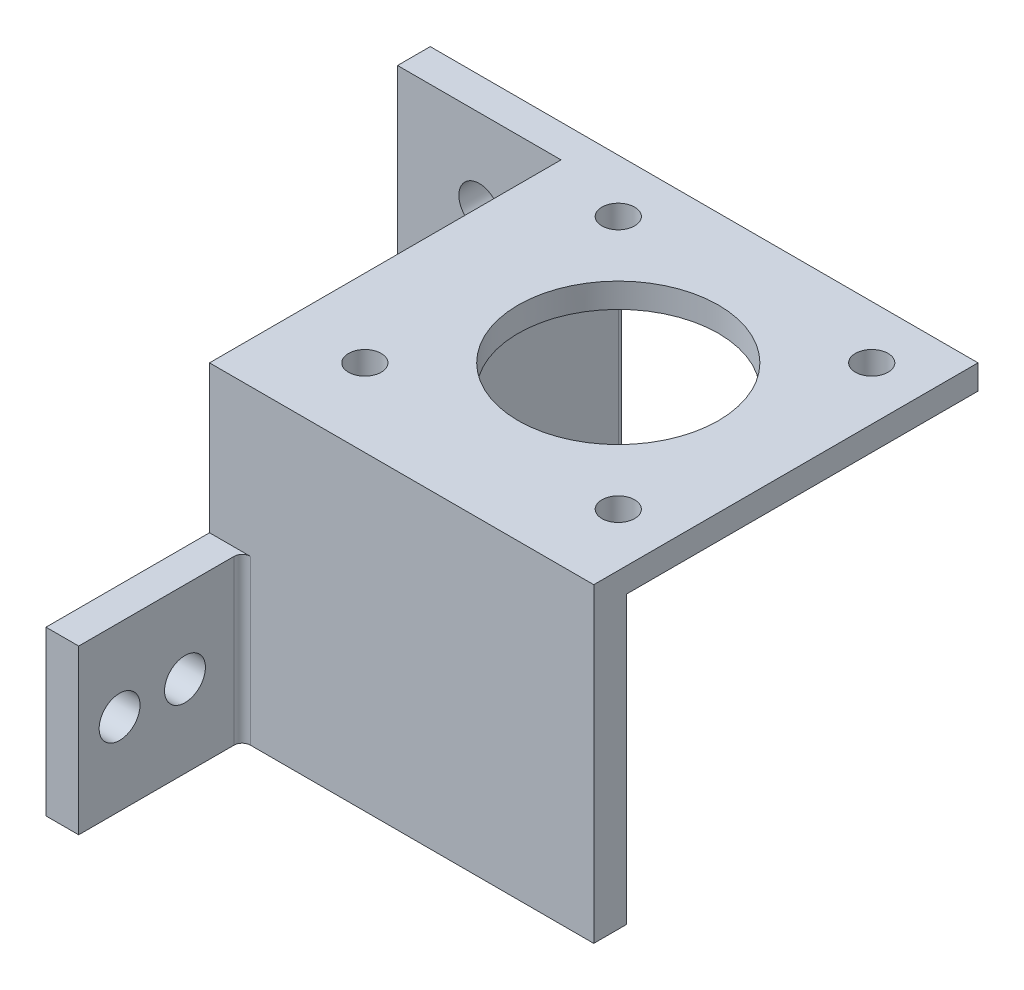
ISO-10303-21;
HEADER;
FILE_DESCRIPTION(('STEP AP214'),'2;1');
FILE_NAME('part.step','',(''),(''),'','','');
FILE_SCHEMA(('AUTOMOTIVE_DESIGN { 1 0 10303 214 1 1 1 1 }'));
ENDSEC;
DATA;
#1=APPLICATION_CONTEXT('core data for automotive mechanical design processes');
#2=APPLICATION_PROTOCOL_DEFINITION('international standard','automotive_design',2000,#1);
#3=PRODUCT_CONTEXT('',#1,'mechanical');
#4=PRODUCT('Part','Part','',(#3));
#5=PRODUCT_RELATED_PRODUCT_CATEGORY('part','',(#4));
#6=PRODUCT_DEFINITION_FORMATION('','',#4);
#7=PRODUCT_DEFINITION_CONTEXT('part definition',#1,'design');
#8=PRODUCT_DEFINITION('design','',#6,#7);
#9=PRODUCT_DEFINITION_SHAPE('','',#8);
#10=(LENGTH_UNIT() NAMED_UNIT(*) SI_UNIT(.MILLI.,.METRE.));
#11=(NAMED_UNIT(*) PLANE_ANGLE_UNIT() SI_UNIT($,.RADIAN.));
#12=(NAMED_UNIT(*) SI_UNIT($,.STERADIAN.) SOLID_ANGLE_UNIT());
#13=UNCERTAINTY_MEASURE_WITH_UNIT(LENGTH_MEASURE(1.E-05),#10,'distance_accuracy_value','');
#14=(GEOMETRIC_REPRESENTATION_CONTEXT(3) GLOBAL_UNCERTAINTY_ASSIGNED_CONTEXT((#13)) GLOBAL_UNIT_ASSIGNED_CONTEXT((#10,
#11,#12)) REPRESENTATION_CONTEXT('',''));
#15=CARTESIAN_POINT('',(0.,0.,0.));
#16=DIRECTION('',(0.,0.,1.));
#17=DIRECTION('',(1.,0.,0.));
#18=AXIS2_PLACEMENT_3D('',#15,#16,#17);
#19=CARTESIAN_POINT('',(47.,38.,8.99999999999999));
#20=DIRECTION('',(0.,0.,-1.));
#21=DIRECTION('',(-1.,0.,0.));
#22=AXIS2_PLACEMENT_3D('',#19,#20,#21);
#23=PLANE('',#22);
#24=DIRECTION('',(-1.,0.,0.));
#25=VECTOR('',#24,1.);
#26=CARTESIAN_POINT('',(4.,20.,9.));
#27=LINE('',#26,#25);
#28=CARTESIAN_POINT('',(5.,20.,9.));
#29=VERTEX_POINT('',#28);
#30=CARTESIAN_POINT('',(0.,20.,9.));
#31=VERTEX_POINT('',#30);
#32=EDGE_CURVE('E56',#29,#31,#27,.T.);
#33=ORIENTED_EDGE('',*,*,#32,.F.);
#34=DIRECTION('',(0.,-1.,0.));
#35=VECTOR('',#34,1.);
#36=CARTESIAN_POINT('',(5.,38.,9.));
#37=LINE('',#36,#35);
#38=CARTESIAN_POINT('',(5.,0.,9.));
#39=VERTEX_POINT('',#38);
#40=EDGE_CURVE('E280',#29,#39,#37,.T.);
#41=ORIENTED_EDGE('',*,*,#40,.T.);
#42=DIRECTION('',(1.,0.,0.));
#43=VECTOR('',#42,1.);
#44=CARTESIAN_POINT('',(47.,0.,8.99999999999999));
#45=LINE('',#44,#43);
#46=CARTESIAN_POINT('',(47.,0.,8.99999999999999));
#47=VERTEX_POINT('',#46);
#48=EDGE_CURVE('E221',#39,#47,#45,.T.);
#49=ORIENTED_EDGE('',*,*,#48,.T.);
#50=DIRECTION('',(0.,-1.,0.));
#51=VECTOR('',#50,1.);
#52=CARTESIAN_POINT('',(47.,38.,8.99999999999999));
#53=LINE('',#52,#51);
#54=CARTESIAN_POINT('',(47.,38.,8.99999999999999));
#55=VERTEX_POINT('',#54);
#56=EDGE_CURVE('E268',#55,#47,#53,.T.);
#57=ORIENTED_EDGE('',*,*,#56,.F.);
#58=DIRECTION('',(1.,0.,0.));
#59=VECTOR('',#58,1.);
#60=CARTESIAN_POINT('',(47.,38.,8.99999999999999));
#61=LINE('',#60,#59);
#62=CARTESIAN_POINT('',(0.,38.,9.));
#63=VERTEX_POINT('',#62);
#64=EDGE_CURVE('E225',#63,#55,#61,.T.);
#65=ORIENTED_EDGE('',*,*,#64,.F.);
#66=DIRECTION('',(0.,-1.,0.));
#67=VECTOR('',#66,1.);
#68=CARTESIAN_POINT('',(0.,38.,9.));
#69=LINE('',#68,#67);
#70=EDGE_CURVE('E271',#63,#31,#69,.T.);
#71=ORIENTED_EDGE('',*,*,#70,.T.);
#72=EDGE_LOOP('',(#33,#41,#49,#57,#65,#71));
#73=FACE_BOUND('',#72,.T.);
#74=ADVANCED_FACE('F33',(#73),#23,.F.);
#75=CARTESIAN_POINT('',(47.,38.,4.99999999999999));
#76=DIRECTION('',(-1.,0.,0.));
#77=DIRECTION('',(0.,0.,1.));
#78=AXIS2_PLACEMENT_3D('',#75,#76,#77);
#79=PLANE('',#78);
#80=DIRECTION('',(0.,0.,-1.));
#81=VECTOR('',#80,1.);
#82=CARTESIAN_POINT('',(47.,0.,4.99999999999999));
#83=LINE('',#82,#81);
#84=CARTESIAN_POINT('',(47.,0.,4.99999999999999));
#85=VERTEX_POINT('',#84);
#86=EDGE_CURVE('E240',#47,#85,#83,.T.);
#87=ORIENTED_EDGE('',*,*,#86,.T.);
#88=DIRECTION('',(0.,-1.,0.));
#89=VECTOR('',#88,1.);
#90=CARTESIAN_POINT('',(47.,38.,4.99999999999999));
#91=LINE('',#90,#89);
#92=CARTESIAN_POINT('',(47.,35.,4.99999999999999));
#93=VERTEX_POINT('',#92);
#94=EDGE_CURVE('E266',#93,#85,#91,.T.);
#95=ORIENTED_EDGE('',*,*,#94,.F.);
#96=DIRECTION('',(0.,0.,-1.));
#97=VECTOR('',#96,1.);
#98=CARTESIAN_POINT('',(47.,35.,4.99999999999999));
#99=LINE('',#98,#97);
#100=CARTESIAN_POINT('',(47.,35.,-38.));
#101=VERTEX_POINT('',#100);
#102=EDGE_CURVE('E213',#93,#101,#99,.T.);
#103=ORIENTED_EDGE('',*,*,#102,.T.);
#104=DIRECTION('',(0.,1.,0.));
#105=VECTOR('',#104,1.);
#106=CARTESIAN_POINT('',(47.,35.,-38.));
#107=LINE('',#106,#105);
#108=CARTESIAN_POINT('',(47.,38.,-38.));
#109=VERTEX_POINT('',#108);
#110=EDGE_CURVE('E218',#101,#109,#107,.T.);
#111=ORIENTED_EDGE('',*,*,#110,.T.);
#112=DIRECTION('',(0.,0.,-1.));
#113=VECTOR('',#112,1.);
#114=CARTESIAN_POINT('',(47.,38.,4.99999999999999));
#115=LINE('',#114,#113);
#116=EDGE_CURVE('E228',#55,#109,#115,.T.);
#117=ORIENTED_EDGE('',*,*,#116,.F.);
#118=ORIENTED_EDGE('',*,*,#56,.T.);
#119=EDGE_LOOP('',(#87,#95,#103,#111,#117,#118));
#120=FACE_BOUND('',#119,.T.);
#121=ADVANCED_FACE('F315',(#120),#79,.F.);
#122=CARTESIAN_POINT('',(4.00000000000001,38.,4.99999999999999));
#123=DIRECTION('',(0.,0.,1.));
#124=DIRECTION('',(1.,0.,0.));
#125=AXIS2_PLACEMENT_3D('',#122,#123,#124);
#126=PLANE('',#125);
#127=DIRECTION('',(0.,-1.,0.));
#128=VECTOR('',#127,1.);
#129=CARTESIAN_POINT('',(4.00000000000001,38.,4.99999999999999));
#130=LINE('',#129,#128);
#131=CARTESIAN_POINT('',(4.00000000000001,35.,4.99999999999999));
#132=VERTEX_POINT('',#131);
#133=CARTESIAN_POINT('',(4.00000000000001,0.,4.99999999999999));
#134=VERTEX_POINT('',#133);
#135=EDGE_CURVE('E264',#132,#134,#130,.T.);
#136=ORIENTED_EDGE('',*,*,#135,.F.);
#137=DIRECTION('',(1.,0.,0.));
#138=VECTOR('',#137,1.);
#139=CARTESIAN_POINT('',(4.00000000000001,35.,4.99999999999999));
#140=LINE('',#139,#138);
#141=EDGE_CURVE('E210',#132,#93,#140,.T.);
#142=ORIENTED_EDGE('',*,*,#141,.T.);
#143=ORIENTED_EDGE('',*,*,#94,.T.);
#144=DIRECTION('',(-1.,0.,0.));
#145=VECTOR('',#144,1.);
#146=CARTESIAN_POINT('',(4.00000000000001,0.,4.99999999999999));
#147=LINE('',#146,#145);
#148=EDGE_CURVE('E243',#85,#134,#147,.T.);
#149=ORIENTED_EDGE('',*,*,#148,.T.);
#150=EDGE_LOOP('',(#136,#142,#143,#149));
#151=FACE_BOUND('',#150,.T.);
#152=ADVANCED_FACE('F318',(#151),#126,.F.);
#153=CARTESIAN_POINT('',(4.,38.,-38.));
#154=DIRECTION('',(-1.,0.,0.));
#155=DIRECTION('',(0.,0.,1.));
#156=AXIS2_PLACEMENT_3D('',#153,#154,#155);
#157=PLANE('',#156);
#158=DIRECTION('',(0.,0.,-1.));
#159=VECTOR('',#158,1.);
#160=CARTESIAN_POINT('',(4.,0.,-38.));
#161=LINE('',#160,#159);
#162=CARTESIAN_POINT('',(4.,0.,-37.));
#163=VERTEX_POINT('',#162);
#164=EDGE_CURVE('E246',#134,#163,#161,.T.);
#165=ORIENTED_EDGE('',*,*,#164,.T.);
#166=DIRECTION('',(0.,-1.,0.));
#167=VECTOR('',#166,1.);
#168=CARTESIAN_POINT('',(4.,38.,-37.));
#169=LINE('',#168,#167);
#170=CARTESIAN_POINT('',(4.00000000000001,35.,-37.));
#171=VERTEX_POINT('',#170);
#172=EDGE_CURVE('E278',#163,#171,#169,.F.);
#173=ORIENTED_EDGE('',*,*,#172,.T.);
#174=DIRECTION('',(0.,0.,1.));
#175=VECTOR('',#174,1.);
#176=CARTESIAN_POINT('',(4.00000000000001,35.,4.99999999999999));
#177=LINE('',#176,#175);
#178=EDGE_CURVE('E208',#171,#132,#177,.T.);
#179=ORIENTED_EDGE('',*,*,#178,.T.);
#180=ORIENTED_EDGE('',*,*,#135,.T.);
#181=EDGE_LOOP('',(#165,#173,#179,#180));
#182=FACE_BOUND('',#181,.T.);
#183=ADVANCED_FACE('F321',(#182),#157,.F.);
#184=CARTESIAN_POINT('',(-20.,38.,-38.));
#185=DIRECTION('',(0.,0.,1.));
#186=DIRECTION('',(1.,0.,0.));
#187=AXIS2_PLACEMENT_3D('',#184,#185,#186);
#188=PLANE('',#187);
#189=CARTESIAN_POINT('',(-10.,10.,-38.));
#190=DIRECTION('',(0.,0.,1.));
#191=DIRECTION('',(1.,0.,0.));
#192=AXIS2_PLACEMENT_3D('',#189,#190,#191);
#193=CIRCLE('',#192,2.5);
#194=CARTESIAN_POINT('',(-7.5,10.,-38.));
#195=VERTEX_POINT('',#194);
#196=EDGE_CURVE('E175',#195,#195,#193,.T.);
#197=ORIENTED_EDGE('',*,*,#196,.T.);
#198=EDGE_LOOP('',(#197));
#199=FACE_BOUND('',#198,.T.);
#200=CARTESIAN_POINT('',(-10.,28.,-38.));
#201=DIRECTION('',(0.,0.,1.));
#202=DIRECTION('',(1.,0.,0.));
#203=AXIS2_PLACEMENT_3D('',#200,#201,#202);
#204=CIRCLE('',#203,2.5);
#205=CARTESIAN_POINT('',(-7.5,28.,-38.));
#206=VERTEX_POINT('',#205);
#207=EDGE_CURVE('E170',#206,#206,#204,.T.);
#208=ORIENTED_EDGE('',*,*,#207,.T.);
#209=EDGE_LOOP('',(#208));
#210=FACE_BOUND('',#209,.T.);
#211=DIRECTION('',(-1.,0.,0.));
#212=VECTOR('',#211,1.);
#213=CARTESIAN_POINT('',(4.00000000000001,35.,-38.));
#214=LINE('',#213,#212);
#215=CARTESIAN_POINT('',(3.,35.,-38.));
#216=VERTEX_POINT('',#215);
#217=EDGE_CURVE('E216',#101,#216,#214,.T.);
#218=ORIENTED_EDGE('',*,*,#217,.T.);
#219=DIRECTION('',(0.,-1.,0.));
#220=VECTOR('',#219,1.);
#221=CARTESIAN_POINT('',(3.,38.,-38.));
#222=LINE('',#221,#220);
#223=CARTESIAN_POINT('',(3.,0.,-38.));
#224=VERTEX_POINT('',#223);
#225=EDGE_CURVE('E273',#216,#224,#222,.T.);
#226=ORIENTED_EDGE('',*,*,#225,.T.);
#227=DIRECTION('',(-1.,0.,0.));
#228=VECTOR('',#227,1.);
#229=CARTESIAN_POINT('',(-20.,0.,-38.));
#230=LINE('',#229,#228);
#231=CARTESIAN_POINT('',(-20.,0.,-38.));
#232=VERTEX_POINT('',#231);
#233=EDGE_CURVE('E249',#224,#232,#230,.T.);
#234=ORIENTED_EDGE('',*,*,#233,.T.);
#235=DIRECTION('',(0.,-1.,0.));
#236=VECTOR('',#235,1.);
#237=CARTESIAN_POINT('',(-20.,38.,-38.));
#238=LINE('',#237,#236);
#239=CARTESIAN_POINT('',(-20.,38.,-38.));
#240=VERTEX_POINT('',#239);
#241=EDGE_CURVE('E261',#240,#232,#238,.T.);
#242=ORIENTED_EDGE('',*,*,#241,.F.);
#243=DIRECTION('',(-1.,0.,0.));
#244=VECTOR('',#243,1.);
#245=CARTESIAN_POINT('',(-20.,38.,-38.));
#246=LINE('',#245,#244);
#247=EDGE_CURVE('E231',#109,#240,#246,.T.);
#248=ORIENTED_EDGE('',*,*,#247,.F.);
#249=ORIENTED_EDGE('',*,*,#110,.F.);
#250=EDGE_LOOP('',(#218,#226,#234,#242,#248,#249));
#251=FACE_BOUND('',#250,.T.);
#252=ADVANCED_FACE('F296',(#199,#210,#251),#188,.F.);
#253=CARTESIAN_POINT('',(-20.,38.,-34.));
#254=DIRECTION('',(1.,0.,0.));
#255=DIRECTION('',(0.,0.,-1.));
#256=AXIS2_PLACEMENT_3D('',#253,#254,#255);
#257=PLANE('',#256);
#258=DIRECTION('',(0.,0.,1.));
#259=VECTOR('',#258,1.);
#260=CARTESIAN_POINT('',(-20.,0.,-34.));
#261=LINE('',#260,#259);
#262=CARTESIAN_POINT('',(-20.,0.,-34.));
#263=VERTEX_POINT('',#262);
#264=EDGE_CURVE('E251',#232,#263,#261,.T.);
#265=ORIENTED_EDGE('',*,*,#264,.T.);
#266=DIRECTION('',(0.,-1.,0.));
#267=VECTOR('',#266,1.);
#268=CARTESIAN_POINT('',(-20.,38.,-34.));
#269=LINE('',#268,#267);
#270=CARTESIAN_POINT('',(-20.,38.,-34.));
#271=VERTEX_POINT('',#270);
#272=EDGE_CURVE('E258',#271,#263,#269,.T.);
#273=ORIENTED_EDGE('',*,*,#272,.F.);
#274=DIRECTION('',(0.,0.,1.));
#275=VECTOR('',#274,1.);
#276=CARTESIAN_POINT('',(-20.,38.,-34.));
#277=LINE('',#276,#275);
#278=EDGE_CURVE('E233',#240,#271,#277,.T.);
#279=ORIENTED_EDGE('',*,*,#278,.F.);
#280=ORIENTED_EDGE('',*,*,#241,.T.);
#281=EDGE_LOOP('',(#265,#273,#279,#280));
#282=FACE_BOUND('',#281,.T.);
#283=ADVANCED_FACE('F303',(#282),#257,.F.);
#284=CARTESIAN_POINT('',(0.,38.,-34.));
#285=DIRECTION('',(0.,0.,-1.));
#286=DIRECTION('',(-1.,0.,0.));
#287=AXIS2_PLACEMENT_3D('',#284,#285,#286);
#288=PLANE('',#287);
#289=CARTESIAN_POINT('',(-10.,10.,-34.));
#290=DIRECTION('',(0.,0.,1.));
#291=DIRECTION('',(1.,0.,0.));
#292=AXIS2_PLACEMENT_3D('',#289,#290,#291);
#293=CIRCLE('',#292,2.5);
#294=CARTESIAN_POINT('',(-7.5,10.,-34.));
#295=VERTEX_POINT('',#294);
#296=EDGE_CURVE('E167',#295,#295,#293,.T.);
#297=ORIENTED_EDGE('',*,*,#296,.F.);
#298=EDGE_LOOP('',(#297));
#299=FACE_BOUND('',#298,.T.);
#300=CARTESIAN_POINT('',(-10.,28.,-34.));
#301=DIRECTION('',(0.,0.,1.));
#302=DIRECTION('',(1.,0.,0.));
#303=AXIS2_PLACEMENT_3D('',#300,#301,#302);
#304=CIRCLE('',#303,2.5);
#305=CARTESIAN_POINT('',(-7.5,28.,-34.));
#306=VERTEX_POINT('',#305);
#307=EDGE_CURVE('E165',#306,#306,#304,.T.);
#308=ORIENTED_EDGE('',*,*,#307,.F.);
#309=EDGE_LOOP('',(#308));
#310=FACE_BOUND('',#309,.T.);
#311=DIRECTION('',(1.,0.,0.));
#312=VECTOR('',#311,1.);
#313=CARTESIAN_POINT('',(0.,0.,-34.));
#314=LINE('',#313,#312);
#315=CARTESIAN_POINT('',(0.,0.,-34.));
#316=VERTEX_POINT('',#315);
#317=EDGE_CURVE('E253',#263,#316,#314,.T.);
#318=ORIENTED_EDGE('',*,*,#317,.T.);
#319=DIRECTION('',(0.,-1.,0.));
#320=VECTOR('',#319,1.);
#321=CARTESIAN_POINT('',(0.,38.,-34.));
#322=LINE('',#321,#320);
#323=CARTESIAN_POINT('',(0.,38.,-34.));
#324=VERTEX_POINT('',#323);
#325=EDGE_CURVE('E238',#324,#316,#322,.T.);
#326=ORIENTED_EDGE('',*,*,#325,.F.);
#327=DIRECTION('',(1.,0.,0.));
#328=VECTOR('',#327,1.);
#329=CARTESIAN_POINT('',(0.,38.,-34.));
#330=LINE('',#329,#328);
#331=EDGE_CURVE('E235',#271,#324,#330,.T.);
#332=ORIENTED_EDGE('',*,*,#331,.F.);
#333=ORIENTED_EDGE('',*,*,#272,.T.);
#334=EDGE_LOOP('',(#318,#326,#332,#333));
#335=FACE_BOUND('',#334,.T.);
#336=ADVANCED_FACE('F307',(#299,#310,#335),#288,.F.);
#337=CARTESIAN_POINT('',(0.,38.,0.));
#338=DIRECTION('',(1.,0.,0.));
#339=DIRECTION('',(0.,0.,-1.));
#340=AXIS2_PLACEMENT_3D('',#337,#338,#339);
#341=PLANE('',#340);
#342=DIRECTION('',(0.,0.,1.));
#343=VECTOR('',#342,1.);
#344=CARTESIAN_POINT('',(0.,0.,0.));
#345=LINE('',#344,#343);
#346=CARTESIAN_POINT('',(0.,0.,29.));
#347=VERTEX_POINT('',#346);
#348=EDGE_CURVE('E226',#316,#347,#345,.T.);
#349=ORIENTED_EDGE('',*,*,#348,.T.);
#350=DIRECTION('',(0.,1.,0.));
#351=VECTOR('',#350,1.);
#352=CARTESIAN_POINT('',(0.,0.,29.));
#353=LINE('',#352,#351);
#354=CARTESIAN_POINT('',(0.,20.,29.));
#355=VERTEX_POINT('',#354);
#356=EDGE_CURVE('E151',#347,#355,#353,.T.);
#357=ORIENTED_EDGE('',*,*,#356,.T.);
#358=DIRECTION('',(0.,0.,-1.));
#359=VECTOR('',#358,1.);
#360=CARTESIAN_POINT('',(0.,20.,9.));
#361=LINE('',#360,#359);
#362=EDGE_CURVE('E145',#355,#31,#361,.T.);
#363=ORIENTED_EDGE('',*,*,#362,.T.);
#364=ORIENTED_EDGE('',*,*,#70,.F.);
#365=DIRECTION('',(0.,0.,1.));
#366=VECTOR('',#365,1.);
#367=CARTESIAN_POINT('',(0.,38.,9.));
#368=LINE('',#367,#366);
#369=EDGE_CURVE('E222',#324,#63,#368,.T.);
#370=ORIENTED_EDGE('',*,*,#369,.F.);
#371=ORIENTED_EDGE('',*,*,#325,.T.);
#372=EDGE_LOOP('',(#349,#357,#363,#364,#370,#371));
#373=FACE_BOUND('',#372,.T.);
#374=CARTESIAN_POINT('',(0.,10.,24.));
#375=DIRECTION('',(-1.,0.,0.));
#376=DIRECTION('',(0.,0.,1.));
#377=AXIS2_PLACEMENT_3D('',#374,#375,#376);
#378=CIRCLE('',#377,2.5);
#379=CARTESIAN_POINT('',(0.,10.,26.5));
#380=VERTEX_POINT('',#379);
#381=EDGE_CURVE('E338',#380,#380,#378,.T.);
#382=ORIENTED_EDGE('',*,*,#381,.F.);
#383=EDGE_LOOP('',(#382));
#384=FACE_BOUND('',#383,.T.);
#385=CARTESIAN_POINT('',(0.,10.,16.));
#386=DIRECTION('',(-1.,0.,0.));
#387=DIRECTION('',(0.,0.,1.));
#388=AXIS2_PLACEMENT_3D('',#385,#386,#387);
#389=CIRCLE('',#388,2.5);
#390=CARTESIAN_POINT('',(0.,10.,18.5));
#391=VERTEX_POINT('',#390);
#392=EDGE_CURVE('E341',#391,#391,#389,.T.);
#393=ORIENTED_EDGE('',*,*,#392,.F.);
#394=EDGE_LOOP('',(#393));
#395=FACE_BOUND('',#394,.T.);
#396=ADVANCED_FACE('F331',(#373,#384,#395),#341,.F.);
#397=CARTESIAN_POINT('',(0.,38.,0.));
#398=DIRECTION('',(0.,1.,0.));
#399=DIRECTION('',(0.,0.,1.));
#400=AXIS2_PLACEMENT_3D('',#397,#398,#399);
#401=PLANE('',#400);
#402=CARTESIAN_POINT('',(25.,38.,-16.));
#403=DIRECTION('',(0.,1.,0.));
#404=DIRECTION('',(0.,0.,1.));
#405=AXIS2_PLACEMENT_3D('',#402,#403,#404);
#406=CIRCLE('',#405,12.25);
#407=CARTESIAN_POINT('',(25.,38.,-3.74999999999998));
#408=VERTEX_POINT('',#407);
#409=EDGE_CURVE('E205',#408,#408,#406,.T.);
#410=ORIENTED_EDGE('',*,*,#409,.F.);
#411=EDGE_LOOP('',(#410));
#412=FACE_BOUND('',#411,.T.);
#413=CARTESIAN_POINT('',(40.4999999999745,38.,-0.499999999999988));
#414=DIRECTION('',(0.,1.,0.));
#415=DIRECTION('',(0.,0.,1.));
#416=AXIS2_PLACEMENT_3D('',#413,#414,#415);
#417=CIRCLE('',#416,2.);
#418=CARTESIAN_POINT('',(40.4999999999745,38.,1.50000000000001));
#419=VERTEX_POINT('',#418);
#420=EDGE_CURVE('E202',#419,#419,#417,.T.);
#421=ORIENTED_EDGE('',*,*,#420,.F.);
#422=EDGE_LOOP('',(#421));
#423=FACE_BOUND('',#422,.T.);
#424=CARTESIAN_POINT('',(9.5,38.,-0.500000000025451));
#425=DIRECTION('',(0.,1.,0.));
#426=DIRECTION('',(0.,0.,1.));
#427=AXIS2_PLACEMENT_3D('',#424,#425,#426);
#428=CIRCLE('',#427,2.);
#429=CARTESIAN_POINT('',(9.5,38.,1.49999999997455));
#430=VERTEX_POINT('',#429);
#431=EDGE_CURVE('E199',#430,#430,#428,.T.);
#432=ORIENTED_EDGE('',*,*,#431,.F.);
#433=EDGE_LOOP('',(#432));
#434=FACE_BOUND('',#433,.T.);
#435=CARTESIAN_POINT('',(9.50000000002546,38.,-31.5));
#436=DIRECTION('',(0.,1.,0.));
#437=DIRECTION('',(0.,0.,1.));
#438=AXIS2_PLACEMENT_3D('',#435,#436,#437);
#439=CIRCLE('',#438,2.);
#440=CARTESIAN_POINT('',(9.50000000002546,38.,-29.5));
#441=VERTEX_POINT('',#440);
#442=EDGE_CURVE('E196',#441,#441,#439,.T.);
#443=ORIENTED_EDGE('',*,*,#442,.F.);
#444=EDGE_LOOP('',(#443));
#445=FACE_BOUND('',#444,.T.);
#446=CARTESIAN_POINT('',(40.5,38.,-31.4999999999745));
#447=DIRECTION('',(0.,1.,0.));
#448=DIRECTION('',(0.,0.,1.));
#449=AXIS2_PLACEMENT_3D('',#446,#447,#448);
#450=CIRCLE('',#449,2.);
#451=CARTESIAN_POINT('',(40.5,38.,-29.4999999999745));
#452=VERTEX_POINT('',#451);
#453=EDGE_CURVE('E193',#452,#452,#450,.T.);
#454=ORIENTED_EDGE('',*,*,#453,.F.);
#455=EDGE_LOOP('',(#454));
#456=FACE_BOUND('',#455,.T.);
#457=ORIENTED_EDGE('',*,*,#116,.T.);
#458=ORIENTED_EDGE('',*,*,#247,.T.);
#459=ORIENTED_EDGE('',*,*,#278,.T.);
#460=ORIENTED_EDGE('',*,*,#331,.T.);
#461=ORIENTED_EDGE('',*,*,#369,.T.);
#462=ORIENTED_EDGE('',*,*,#64,.T.);
#463=EDGE_LOOP('',(#457,#458,#459,#460,#461,#462));
#464=FACE_BOUND('',#463,.T.);
#465=ADVANCED_FACE('F310',(#412,#423,#434,#445,#456,#464),#401,.T.);
#466=CARTESIAN_POINT('',(0.,0.,0.));
#467=DIRECTION('',(0.,1.,0.));
#468=DIRECTION('',(0.,0.,1.));
#469=AXIS2_PLACEMENT_3D('',#466,#467,#468);
#470=PLANE('',#469);
#471=ORIENTED_EDGE('',*,*,#233,.F.);
#472=CARTESIAN_POINT('',(3.,0.,-37.));
#473=DIRECTION('',(0.,1.,0.));
#474=DIRECTION('',(0.,0.,1.));
#475=AXIS2_PLACEMENT_3D('',#472,#473,#474);
#476=CIRCLE('',#475,1.);
#477=EDGE_CURVE('E276',#224,#163,#476,.F.);
#478=ORIENTED_EDGE('',*,*,#477,.T.);
#479=ORIENTED_EDGE('',*,*,#164,.F.);
#480=ORIENTED_EDGE('',*,*,#148,.F.);
#481=ORIENTED_EDGE('',*,*,#86,.F.);
#482=ORIENTED_EDGE('',*,*,#48,.F.);
#483=CARTESIAN_POINT('',(5.,0.,10.));
#484=DIRECTION('',(0.,1.,0.));
#485=DIRECTION('',(0.,0.,1.));
#486=AXIS2_PLACEMENT_3D('',#483,#484,#485);
#487=CIRCLE('',#486,1.);
#488=CARTESIAN_POINT('',(4.,0.,10.));
#489=VERTEX_POINT('',#488);
#490=EDGE_CURVE('E41',#39,#489,#487,.T.);
#491=ORIENTED_EDGE('',*,*,#490,.T.);
#492=DIRECTION('',(0.,0.,1.));
#493=VECTOR('',#492,1.);
#494=CARTESIAN_POINT('',(4.,0.,9.));
#495=LINE('',#494,#493);
#496=CARTESIAN_POINT('',(4.,0.,29.));
#497=VERTEX_POINT('',#496);
#498=EDGE_CURVE('E135',#489,#497,#495,.T.);
#499=ORIENTED_EDGE('',*,*,#498,.T.);
#500=DIRECTION('',(-1.,0.,0.));
#501=VECTOR('',#500,1.);
#502=CARTESIAN_POINT('',(4.,0.,29.));
#503=LINE('',#502,#501);
#504=EDGE_CURVE('E140',#497,#347,#503,.T.);
#505=ORIENTED_EDGE('',*,*,#504,.T.);
#506=ORIENTED_EDGE('',*,*,#348,.F.);
#507=ORIENTED_EDGE('',*,*,#317,.F.);
#508=ORIENTED_EDGE('',*,*,#264,.F.);
#509=EDGE_LOOP('',(#471,#478,#479,#480,#481,#482,#491,#499,#505,#506,#507,#508));
#510=FACE_BOUND('',#509,.T.);
#511=ADVANCED_FACE('F138',(#510),#470,.F.);
#512=CARTESIAN_POINT('',(0.,35.,0.));
#513=DIRECTION('',(0.,-1.,0.));
#514=DIRECTION('',(0.,0.,-1.));
#515=AXIS2_PLACEMENT_3D('',#512,#513,#514);
#516=PLANE('',#515);
#517=CARTESIAN_POINT('',(25.,35.,-16.));
#518=DIRECTION('',(0.,-1.,0.));
#519=DIRECTION('',(0.,0.,-1.));
#520=AXIS2_PLACEMENT_3D('',#517,#518,#519);
#521=CIRCLE('',#520,12.25);
#522=CARTESIAN_POINT('',(25.,35.,-28.25));
#523=VERTEX_POINT('',#522);
#524=EDGE_CURVE('E178',#523,#523,#521,.T.);
#525=ORIENTED_EDGE('',*,*,#524,.F.);
#526=EDGE_LOOP('',(#525));
#527=FACE_BOUND('',#526,.T.);
#528=CARTESIAN_POINT('',(40.4999999999745,35.,-0.499999999999988));
#529=DIRECTION('',(0.,-1.,0.));
#530=DIRECTION('',(0.,0.,-1.));
#531=AXIS2_PLACEMENT_3D('',#528,#529,#530);
#532=CIRCLE('',#531,2.);
#533=CARTESIAN_POINT('',(40.4999999999745,35.,-2.49999999999999));
#534=VERTEX_POINT('',#533);
#535=EDGE_CURVE('E186',#534,#534,#532,.T.);
#536=ORIENTED_EDGE('',*,*,#535,.F.);
#537=EDGE_LOOP('',(#536));
#538=FACE_BOUND('',#537,.T.);
#539=CARTESIAN_POINT('',(9.5,35.,-0.500000000025451));
#540=DIRECTION('',(0.,-1.,0.));
#541=DIRECTION('',(0.,0.,-1.));
#542=AXIS2_PLACEMENT_3D('',#539,#540,#541);
#543=CIRCLE('',#542,2.);
#544=CARTESIAN_POINT('',(9.5,35.,-2.50000000002545));
#545=VERTEX_POINT('',#544);
#546=EDGE_CURVE('E183',#545,#545,#543,.T.);
#547=ORIENTED_EDGE('',*,*,#546,.F.);
#548=EDGE_LOOP('',(#547));
#549=FACE_BOUND('',#548,.T.);
#550=CARTESIAN_POINT('',(9.50000000002546,35.,-31.5));
#551=DIRECTION('',(0.,-1.,0.));
#552=DIRECTION('',(0.,0.,-1.));
#553=AXIS2_PLACEMENT_3D('',#550,#551,#552);
#554=CIRCLE('',#553,2.);
#555=CARTESIAN_POINT('',(9.50000000002546,35.,-33.5));
#556=VERTEX_POINT('',#555);
#557=EDGE_CURVE('E179',#556,#556,#554,.T.);
#558=ORIENTED_EDGE('',*,*,#557,.F.);
#559=EDGE_LOOP('',(#558));
#560=FACE_BOUND('',#559,.T.);
#561=CARTESIAN_POINT('',(40.5,35.,-31.4999999999745));
#562=DIRECTION('',(0.,-1.,0.));
#563=DIRECTION('',(0.,0.,-1.));
#564=AXIS2_PLACEMENT_3D('',#561,#562,#563);
#565=CIRCLE('',#564,2.);
#566=CARTESIAN_POINT('',(40.5,35.,-33.4999999999745));
#567=VERTEX_POINT('',#566);
#568=EDGE_CURVE('E182',#567,#567,#565,.T.);
#569=ORIENTED_EDGE('',*,*,#568,.F.);
#570=EDGE_LOOP('',(#569));
#571=FACE_BOUND('',#570,.T.);
#572=ORIENTED_EDGE('',*,*,#178,.F.);
#573=CARTESIAN_POINT('',(3.,35.,-37.));
#574=DIRECTION('',(0.,-1.,0.));
#575=DIRECTION('',(0.,0.,-1.));
#576=AXIS2_PLACEMENT_3D('',#573,#574,#575);
#577=CIRCLE('',#576,1.);
#578=EDGE_CURVE('E283',#171,#216,#577,.F.);
#579=ORIENTED_EDGE('',*,*,#578,.T.);
#580=ORIENTED_EDGE('',*,*,#217,.F.);
#581=ORIENTED_EDGE('',*,*,#102,.F.);
#582=ORIENTED_EDGE('',*,*,#141,.F.);
#583=EDGE_LOOP('',(#572,#579,#580,#581,#582));
#584=FACE_BOUND('',#583,.T.);
#585=ADVANCED_FACE('F290',(#527,#538,#549,#560,#571,#584),#516,.T.);
#586=CARTESIAN_POINT('',(40.5,45.,-31.4999999999745));
#587=DIRECTION('',(0.,-1.,0.));
#588=DIRECTION('',(0.,0.,-1.));
#589=AXIS2_PLACEMENT_3D('',#586,#587,#588);
#590=CYLINDRICAL_SURFACE('',#589,2.);
#591=ORIENTED_EDGE('',*,*,#453,.T.);
#592=EDGE_LOOP('',(#591));
#593=FACE_BOUND('',#592,.T.);
#594=ORIENTED_EDGE('',*,*,#568,.T.);
#595=EDGE_LOOP('',(#594));
#596=FACE_BOUND('',#595,.T.);
#597=ADVANCED_FACE('F388',(#593,#596),#590,.F.);
#598=CARTESIAN_POINT('',(9.50000000002546,45.,-31.5));
#599=DIRECTION('',(0.,-1.,0.));
#600=DIRECTION('',(0.,0.,-1.));
#601=AXIS2_PLACEMENT_3D('',#598,#599,#600);
#602=CYLINDRICAL_SURFACE('',#601,2.);
#603=ORIENTED_EDGE('',*,*,#442,.T.);
#604=EDGE_LOOP('',(#603));
#605=FACE_BOUND('',#604,.T.);
#606=ORIENTED_EDGE('',*,*,#557,.T.);
#607=EDGE_LOOP('',(#606));
#608=FACE_BOUND('',#607,.T.);
#609=ADVANCED_FACE('F392',(#605,#608),#602,.F.);
#610=CARTESIAN_POINT('',(9.5,45.,-0.500000000025451));
#611=DIRECTION('',(0.,-1.,0.));
#612=DIRECTION('',(0.,0.,-1.));
#613=AXIS2_PLACEMENT_3D('',#610,#611,#612);
#614=CYLINDRICAL_SURFACE('',#613,2.);
#615=ORIENTED_EDGE('',*,*,#431,.T.);
#616=EDGE_LOOP('',(#615));
#617=FACE_BOUND('',#616,.T.);
#618=ORIENTED_EDGE('',*,*,#546,.T.);
#619=EDGE_LOOP('',(#618));
#620=FACE_BOUND('',#619,.T.);
#621=ADVANCED_FACE('F402',(#617,#620),#614,.F.);
#622=CARTESIAN_POINT('',(40.4999999999745,45.,-0.499999999999988));
#623=DIRECTION('',(0.,-1.,0.));
#624=DIRECTION('',(0.,0.,-1.));
#625=AXIS2_PLACEMENT_3D('',#622,#623,#624);
#626=CYLINDRICAL_SURFACE('',#625,2.);
#627=ORIENTED_EDGE('',*,*,#420,.T.);
#628=EDGE_LOOP('',(#627));
#629=FACE_BOUND('',#628,.T.);
#630=ORIENTED_EDGE('',*,*,#535,.T.);
#631=EDGE_LOOP('',(#630));
#632=FACE_BOUND('',#631,.T.);
#633=ADVANCED_FACE('F398',(#629,#632),#626,.F.);
#634=CARTESIAN_POINT('',(25.,45.,-16.));
#635=DIRECTION('',(0.,-1.,0.));
#636=DIRECTION('',(0.,0.,-1.));
#637=AXIS2_PLACEMENT_3D('',#634,#635,#636);
#638=CYLINDRICAL_SURFACE('',#637,12.25);
#639=ORIENTED_EDGE('',*,*,#409,.T.);
#640=EDGE_LOOP('',(#639));
#641=FACE_BOUND('',#640,.T.);
#642=ORIENTED_EDGE('',*,*,#524,.T.);
#643=EDGE_LOOP('',(#642));
#644=FACE_BOUND('',#643,.T.);
#645=ADVANCED_FACE('F394',(#641,#644),#638,.F.);
#646=CARTESIAN_POINT('',(-10.,28.,-44.));
#647=DIRECTION('',(0.,0.,1.));
#648=DIRECTION('',(1.,0.,0.));
#649=AXIS2_PLACEMENT_3D('',#646,#647,#648);
#650=CYLINDRICAL_SURFACE('',#649,2.5);
#651=ORIENTED_EDGE('',*,*,#307,.T.);
#652=EDGE_LOOP('',(#651));
#653=FACE_BOUND('',#652,.T.);
#654=ORIENTED_EDGE('',*,*,#207,.F.);
#655=EDGE_LOOP('',(#654));
#656=FACE_BOUND('',#655,.T.);
#657=ADVANCED_FACE('F397',(#653,#656),#650,.F.);
#658=CARTESIAN_POINT('',(-10.,10.,-44.));
#659=DIRECTION('',(0.,0.,1.));
#660=DIRECTION('',(1.,0.,0.));
#661=AXIS2_PLACEMENT_3D('',#658,#659,#660);
#662=CYLINDRICAL_SURFACE('',#661,2.5);
#663=ORIENTED_EDGE('',*,*,#296,.T.);
#664=EDGE_LOOP('',(#663));
#665=FACE_BOUND('',#664,.T.);
#666=ORIENTED_EDGE('',*,*,#196,.F.);
#667=EDGE_LOOP('',(#666));
#668=FACE_BOUND('',#667,.T.);
#669=ADVANCED_FACE('F412',(#665,#668),#662,.F.);
#670=CARTESIAN_POINT('',(4.,20.,9.));
#671=DIRECTION('',(0.,1.,0.));
#672=DIRECTION('',(0.,0.,1.));
#673=AXIS2_PLACEMENT_3D('',#670,#671,#672);
#674=PLANE('',#673);
#675=ORIENTED_EDGE('',*,*,#362,.F.);
#676=DIRECTION('',(-1.,0.,0.));
#677=VECTOR('',#676,1.);
#678=CARTESIAN_POINT('',(4.,20.,29.));
#679=LINE('',#678,#677);
#680=CARTESIAN_POINT('',(4.,20.,29.));
#681=VERTEX_POINT('',#680);
#682=EDGE_CURVE('E152',#681,#355,#679,.T.);
#683=ORIENTED_EDGE('',*,*,#682,.F.);
#684=DIRECTION('',(0.,0.,-1.));
#685=VECTOR('',#684,1.);
#686=CARTESIAN_POINT('',(4.,20.,9.));
#687=LINE('',#686,#685);
#688=CARTESIAN_POINT('',(4.,20.,10.));
#689=VERTEX_POINT('',#688);
#690=EDGE_CURVE('E153',#681,#689,#687,.T.);
#691=ORIENTED_EDGE('',*,*,#690,.T.);
#692=CARTESIAN_POINT('',(5.,20.,10.));
#693=DIRECTION('',(0.,1.,0.));
#694=DIRECTION('',(0.,0.,1.));
#695=AXIS2_PLACEMENT_3D('',#692,#693,#694);
#696=CIRCLE('',#695,1.);
#697=EDGE_CURVE('E11',#689,#29,#696,.F.);
#698=ORIENTED_EDGE('',*,*,#697,.T.);
#699=ORIENTED_EDGE('',*,*,#32,.T.);
#700=EDGE_LOOP('',(#675,#683,#691,#698,#699));
#701=FACE_BOUND('',#700,.T.);
#702=ADVANCED_FACE('F329',(#701),#674,.T.);
#703=CARTESIAN_POINT('',(4.,0.,29.));
#704=DIRECTION('',(0.,0.,1.));
#705=DIRECTION('',(1.,0.,0.));
#706=AXIS2_PLACEMENT_3D('',#703,#704,#705);
#707=PLANE('',#706);
#708=ORIENTED_EDGE('',*,*,#356,.F.);
#709=ORIENTED_EDGE('',*,*,#504,.F.);
#710=DIRECTION('',(0.,1.,0.));
#711=VECTOR('',#710,1.);
#712=CARTESIAN_POINT('',(4.,0.,29.));
#713=LINE('',#712,#711);
#714=EDGE_CURVE('E144',#497,#681,#713,.T.);
#715=ORIENTED_EDGE('',*,*,#714,.T.);
#716=ORIENTED_EDGE('',*,*,#682,.T.);
#717=EDGE_LOOP('',(#708,#709,#715,#716));
#718=FACE_BOUND('',#717,.T.);
#719=ADVANCED_FACE('F149',(#718),#707,.T.);
#720=CARTESIAN_POINT('',(4.,0.,0.));
#721=DIRECTION('',(1.,0.,0.));
#722=DIRECTION('',(0.,0.,-1.));
#723=AXIS2_PLACEMENT_3D('',#720,#721,#722);
#724=PLANE('',#723);
#725=CARTESIAN_POINT('',(4.,10.,24.));
#726=DIRECTION('',(-1.,0.,0.));
#727=DIRECTION('',(0.,0.,1.));
#728=AXIS2_PLACEMENT_3D('',#725,#726,#727);
#729=CIRCLE('',#728,2.5);
#730=CARTESIAN_POINT('',(4.,10.,26.5));
#731=VERTEX_POINT('',#730);
#732=EDGE_CURVE('E343',#731,#731,#729,.T.);
#733=ORIENTED_EDGE('',*,*,#732,.T.);
#734=EDGE_LOOP('',(#733));
#735=FACE_BOUND('',#734,.T.);
#736=CARTESIAN_POINT('',(4.,10.,16.));
#737=DIRECTION('',(-1.,0.,0.));
#738=DIRECTION('',(0.,0.,1.));
#739=AXIS2_PLACEMENT_3D('',#736,#737,#738);
#740=CIRCLE('',#739,2.5);
#741=CARTESIAN_POINT('',(4.,10.,18.5));
#742=VERTEX_POINT('',#741);
#743=EDGE_CURVE('E161',#742,#742,#740,.T.);
#744=ORIENTED_EDGE('',*,*,#743,.T.);
#745=EDGE_LOOP('',(#744));
#746=FACE_BOUND('',#745,.T.);
#747=ORIENTED_EDGE('',*,*,#498,.F.);
#748=DIRECTION('',(0.,-1.,0.));
#749=VECTOR('',#748,1.);
#750=CARTESIAN_POINT('',(4.,0.,10.));
#751=LINE('',#750,#749);
#752=EDGE_CURVE('E48',#489,#689,#751,.F.);
#753=ORIENTED_EDGE('',*,*,#752,.T.);
#754=ORIENTED_EDGE('',*,*,#690,.F.);
#755=ORIENTED_EDGE('',*,*,#714,.F.);
#756=EDGE_LOOP('',(#747,#753,#754,#755));
#757=FACE_BOUND('',#756,.T.);
#758=ADVANCED_FACE('F155',(#735,#746,#757),#724,.T.);
#759=CARTESIAN_POINT('',(4.,10.,16.));
#760=DIRECTION('',(-1.,0.,0.));
#761=DIRECTION('',(0.,0.,1.));
#762=AXIS2_PLACEMENT_3D('',#759,#760,#761);
#763=CYLINDRICAL_SURFACE('',#762,2.5);
#764=ORIENTED_EDGE('',*,*,#743,.F.);
#765=EDGE_LOOP('',(#764));
#766=FACE_BOUND('',#765,.T.);
#767=ORIENTED_EDGE('',*,*,#392,.T.);
#768=EDGE_LOOP('',(#767));
#769=FACE_BOUND('',#768,.T.);
#770=ADVANCED_FACE('F352',(#766,#769),#763,.F.);
#771=CARTESIAN_POINT('',(4.,10.,24.));
#772=DIRECTION('',(-1.,0.,0.));
#773=DIRECTION('',(0.,0.,1.));
#774=AXIS2_PLACEMENT_3D('',#771,#772,#773);
#775=CYLINDRICAL_SURFACE('',#774,2.5);
#776=ORIENTED_EDGE('',*,*,#732,.F.);
#777=EDGE_LOOP('',(#776));
#778=FACE_BOUND('',#777,.T.);
#779=ORIENTED_EDGE('',*,*,#381,.T.);
#780=EDGE_LOOP('',(#779));
#781=FACE_BOUND('',#780,.T.);
#782=ADVANCED_FACE('F350',(#778,#781),#775,.F.);
#783=CARTESIAN_POINT('',(3.,38.,-37.));
#784=DIRECTION('',(0.,-1.,0.));
#785=DIRECTION('',(0.,0.,-1.));
#786=AXIS2_PLACEMENT_3D('',#783,#784,#785);
#787=CYLINDRICAL_SURFACE('',#786,1.);
#788=ORIENTED_EDGE('',*,*,#578,.F.);
#789=ORIENTED_EDGE('',*,*,#172,.F.);
#790=ORIENTED_EDGE('',*,*,#477,.F.);
#791=ORIENTED_EDGE('',*,*,#225,.F.);
#792=EDGE_LOOP('',(#788,#789,#790,#791));
#793=FACE_BOUND('',#792,.T.);
#794=ADVANCED_FACE('F294',(#793),#787,.T.);
#795=CARTESIAN_POINT('',(5.,38.,10.));
#796=DIRECTION('',(0.,-1.,0.));
#797=DIRECTION('',(0.,0.,-1.));
#798=AXIS2_PLACEMENT_3D('',#795,#796,#797);
#799=CYLINDRICAL_SURFACE('',#798,1.);
#800=ORIENTED_EDGE('',*,*,#697,.F.);
#801=ORIENTED_EDGE('',*,*,#752,.F.);
#802=ORIENTED_EDGE('',*,*,#490,.F.);
#803=ORIENTED_EDGE('',*,*,#40,.F.);
#804=EDGE_LOOP('',(#800,#801,#802,#803));
#805=FACE_BOUND('',#804,.T.);
#806=ADVANCED_FACE('F35',(#805),#799,.F.);
#807=CLOSED_SHELL('',(#74,#121,#152,#183,#252,#283,#336,#396,#465,#511,#585,#597,#609,#621,#633,
#645,#657,#669,#702,#719,#758,#770,#782,#794,#806));
#808=MANIFOLD_SOLID_BREP('B2',#807);
#809=ADVANCED_BREP_SHAPE_REPRESENTATION('',(#18,#808),#14);
#810=SHAPE_DEFINITION_REPRESENTATION(#9,#809);
ENDSEC;
END-ISO-10303-21;
